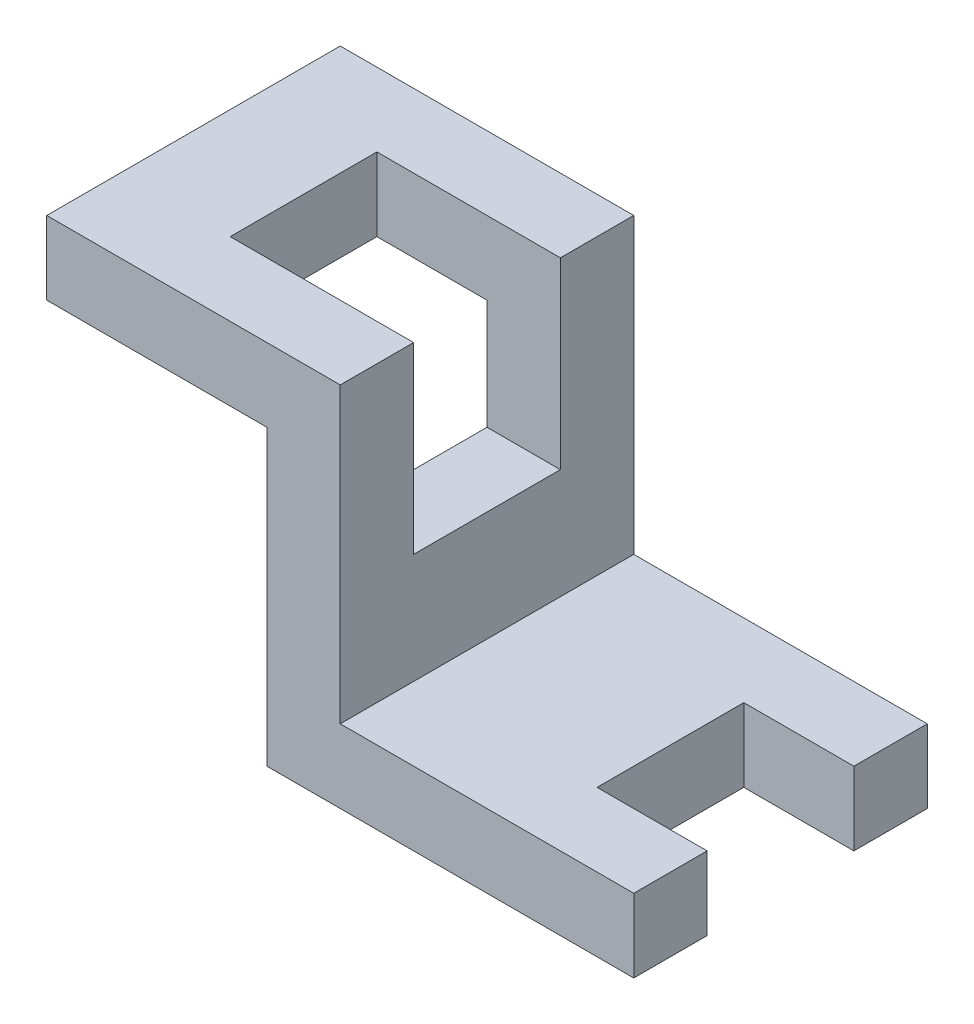
ISO-10303-21;
HEADER;
FILE_DESCRIPTION(('STEP AP214'),'2;1');
FILE_NAME('part.step','',(''),(''),'','','');
FILE_SCHEMA(('AUTOMOTIVE_DESIGN { 1 0 10303 214 1 1 1 1 }'));
ENDSEC;
DATA;
#1=APPLICATION_CONTEXT('core data for automotive mechanical design processes');
#2=APPLICATION_PROTOCOL_DEFINITION('international standard','automotive_design',2000,#1);
#3=PRODUCT_CONTEXT('',#1,'mechanical');
#4=PRODUCT('Part','Part','',(#3));
#5=PRODUCT_RELATED_PRODUCT_CATEGORY('part','',(#4));
#6=PRODUCT_DEFINITION_FORMATION('','',#4);
#7=PRODUCT_DEFINITION_CONTEXT('part definition',#1,'design');
#8=PRODUCT_DEFINITION('design','',#6,#7);
#9=PRODUCT_DEFINITION_SHAPE('','',#8);
#10=(LENGTH_UNIT() NAMED_UNIT(*) SI_UNIT(.MILLI.,.METRE.));
#11=(NAMED_UNIT(*) PLANE_ANGLE_UNIT() SI_UNIT($,.RADIAN.));
#12=(NAMED_UNIT(*) SI_UNIT($,.STERADIAN.) SOLID_ANGLE_UNIT());
#13=UNCERTAINTY_MEASURE_WITH_UNIT(LENGTH_MEASURE(1.E-05),#10,'distance_accuracy_value','');
#14=(GEOMETRIC_REPRESENTATION_CONTEXT(3) GLOBAL_UNCERTAINTY_ASSIGNED_CONTEXT((#13)) GLOBAL_UNIT_ASSIGNED_CONTEXT((#10,
#11,#12)) REPRESENTATION_CONTEXT('',''));
#15=CARTESIAN_POINT('',(0.,0.,0.));
#16=DIRECTION('',(0.,0.,1.));
#17=DIRECTION('',(1.,0.,0.));
#18=AXIS2_PLACEMENT_3D('',#15,#16,#17);
#19=CARTESIAN_POINT('',(80.,-50.,40.));
#20=DIRECTION('',(-1.,0.,0.));
#21=DIRECTION('',(0.,0.,1.));
#22=AXIS2_PLACEMENT_3D('',#19,#20,#21);
#23=PLANE('',#22);
#24=DIRECTION('',(0.,-1.,0.));
#25=VECTOR('',#24,1.);
#26=CARTESIAN_POINT('',(80.,-40.,30.));
#27=LINE('',#26,#25);
#28=CARTESIAN_POINT('',(80.,-40.,30.));
#29=VERTEX_POINT('',#28);
#30=CARTESIAN_POINT('',(80.,-50.,30.));
#31=VERTEX_POINT('',#30);
#32=EDGE_CURVE('E174',#29,#31,#27,.T.);
#33=ORIENTED_EDGE('',*,*,#32,.F.);
#34=DIRECTION('',(0.,0.,-1.));
#35=VECTOR('',#34,1.);
#36=CARTESIAN_POINT('',(80.,-40.,40.));
#37=LINE('',#36,#35);
#38=CARTESIAN_POINT('',(80.,-40.,40.));
#39=VERTEX_POINT('',#38);
#40=EDGE_CURVE('E170',#39,#29,#37,.T.);
#41=ORIENTED_EDGE('',*,*,#40,.F.);
#42=DIRECTION('',(0.,1.,0.));
#43=VECTOR('',#42,1.);
#44=CARTESIAN_POINT('',(80.,-50.,40.));
#45=LINE('',#44,#43);
#46=CARTESIAN_POINT('',(80.,-50.,40.));
#47=VERTEX_POINT('',#46);
#48=EDGE_CURVE('E266',#47,#39,#45,.T.);
#49=ORIENTED_EDGE('',*,*,#48,.F.);
#50=DIRECTION('',(0.,0.,-1.));
#51=VECTOR('',#50,1.);
#52=CARTESIAN_POINT('',(80.,-50.,40.));
#53=LINE('',#52,#51);
#54=EDGE_CURVE('E315',#47,#31,#53,.T.);
#55=ORIENTED_EDGE('',*,*,#54,.T.);
#56=EDGE_LOOP('',(#33,#41,#49,#55));
#57=FACE_BOUND('',#56,.T.);
#58=ADVANCED_FACE('F39',(#57),#23,.F.);
#59=CARTESIAN_POINT('',(30.,-50.,40.));
#60=DIRECTION('',(0.,1.,0.));
#61=DIRECTION('',(0.,0.,1.));
#62=AXIS2_PLACEMENT_3D('',#59,#60,#61);
#63=PLANE('',#62);
#64=DIRECTION('',(1.,0.,0.));
#65=VECTOR('',#64,1.);
#66=CARTESIAN_POINT('',(30.,-50.,10.));
#67=LINE('',#66,#65);
#68=CARTESIAN_POINT('',(65.,-50.,10.));
#69=VERTEX_POINT('',#68);
#70=CARTESIAN_POINT('',(80.,-50.,10.));
#71=VERTEX_POINT('',#70);
#72=EDGE_CURVE('E11',#69,#71,#67,.T.);
#73=ORIENTED_EDGE('',*,*,#72,.F.);
#74=DIRECTION('',(0.,0.,-1.));
#75=VECTOR('',#74,1.);
#76=CARTESIAN_POINT('',(65.,-50.,40.));
#77=LINE('',#76,#75);
#78=CARTESIAN_POINT('',(65.,-50.,30.));
#79=VERTEX_POINT('',#78);
#80=EDGE_CURVE('E57',#79,#69,#77,.T.);
#81=ORIENTED_EDGE('',*,*,#80,.F.);
#82=DIRECTION('',(-1.,0.,0.));
#83=VECTOR('',#82,1.);
#84=CARTESIAN_POINT('',(30.,-50.,30.));
#85=LINE('',#84,#83);
#86=EDGE_CURVE('E48',#31,#79,#85,.T.);
#87=ORIENTED_EDGE('',*,*,#86,.F.);
#88=ORIENTED_EDGE('',*,*,#54,.F.);
#89=DIRECTION('',(1.,0.,0.));
#90=VECTOR('',#89,1.);
#91=CARTESIAN_POINT('',(30.,-50.,40.));
#92=LINE('',#91,#90);
#93=CARTESIAN_POINT('',(30.,-50.,40.));
#94=VERTEX_POINT('',#93);
#95=EDGE_CURVE('E263',#94,#47,#92,.T.);
#96=ORIENTED_EDGE('',*,*,#95,.F.);
#97=DIRECTION('',(0.,0.,-1.));
#98=VECTOR('',#97,1.);
#99=CARTESIAN_POINT('',(30.,-50.,40.));
#100=LINE('',#99,#98);
#101=CARTESIAN_POINT('',(30.,-50.,0.));
#102=VERTEX_POINT('',#101);
#103=EDGE_CURVE('E319',#94,#102,#100,.T.);
#104=ORIENTED_EDGE('',*,*,#103,.T.);
#105=DIRECTION('',(1.,0.,0.));
#106=VECTOR('',#105,1.);
#107=CARTESIAN_POINT('',(30.,-50.,0.));
#108=LINE('',#107,#106);
#109=CARTESIAN_POINT('',(80.,-50.,0.));
#110=VERTEX_POINT('',#109);
#111=EDGE_CURVE('E289',#102,#110,#108,.T.);
#112=ORIENTED_EDGE('',*,*,#111,.T.);
#113=EDGE_CURVE('E314',#71,#110,#53,.T.);
#114=ORIENTED_EDGE('',*,*,#113,.F.);
#115=EDGE_LOOP('',(#73,#81,#87,#88,#96,#104,#112,#114));
#116=FACE_BOUND('',#115,.T.);
#117=ADVANCED_FACE('F379',(#116),#63,.F.);
#118=CARTESIAN_POINT('',(80.,-40.,40.));
#119=DIRECTION('',(0.,-1.,0.));
#120=DIRECTION('',(1.,0.,0.));
#121=AXIS2_PLACEMENT_3D('',#118,#119,#120);
#122=PLANE('',#121);
#123=DIRECTION('',(-1.,0.,0.));
#124=VECTOR('',#123,1.);
#125=CARTESIAN_POINT('',(80.,-40.,10.));
#126=LINE('',#125,#124);
#127=CARTESIAN_POINT('',(80.,-40.,10.));
#128=VERTEX_POINT('',#127);
#129=CARTESIAN_POINT('',(65.,-40.,10.));
#130=VERTEX_POINT('',#129);
#131=EDGE_CURVE('E191',#128,#130,#126,.T.);
#132=ORIENTED_EDGE('',*,*,#131,.F.);
#133=CARTESIAN_POINT('',(80.,-40.,0.));
#134=VERTEX_POINT('',#133);
#135=EDGE_CURVE('E311',#128,#134,#37,.T.);
#136=ORIENTED_EDGE('',*,*,#135,.T.);
#137=DIRECTION('',(-1.,0.,0.));
#138=VECTOR('',#137,1.);
#139=CARTESIAN_POINT('',(80.,-40.,0.));
#140=LINE('',#139,#138);
#141=CARTESIAN_POINT('',(40.,-40.,0.));
#142=VERTEX_POINT('',#141);
#143=EDGE_CURVE('E297',#134,#142,#140,.T.);
#144=ORIENTED_EDGE('',*,*,#143,.T.);
#145=DIRECTION('',(0.,0.,-1.));
#146=VECTOR('',#145,1.);
#147=CARTESIAN_POINT('',(40.,-40.,40.));
#148=LINE('',#147,#146);
#149=CARTESIAN_POINT('',(40.,-40.,40.));
#150=VERTEX_POINT('',#149);
#151=EDGE_CURVE('E307',#150,#142,#148,.T.);
#152=ORIENTED_EDGE('',*,*,#151,.F.);
#153=DIRECTION('',(-1.,0.,0.));
#154=VECTOR('',#153,1.);
#155=CARTESIAN_POINT('',(80.,-40.,40.));
#156=LINE('',#155,#154);
#157=EDGE_CURVE('E269',#39,#150,#156,.T.);
#158=ORIENTED_EDGE('',*,*,#157,.F.);
#159=ORIENTED_EDGE('',*,*,#40,.T.);
#160=DIRECTION('',(1.,0.,0.));
#161=VECTOR('',#160,1.);
#162=CARTESIAN_POINT('',(65.,-40.,30.));
#163=LINE('',#162,#161);
#164=CARTESIAN_POINT('',(65.,-40.,30.));
#165=VERTEX_POINT('',#164);
#166=EDGE_CURVE('E162',#165,#29,#163,.T.);
#167=ORIENTED_EDGE('',*,*,#166,.F.);
#168=DIRECTION('',(0.,0.,1.));
#169=VECTOR('',#168,1.);
#170=CARTESIAN_POINT('',(65.,-40.,10.));
#171=LINE('',#170,#169);
#172=EDGE_CURVE('E166',#130,#165,#171,.T.);
#173=ORIENTED_EDGE('',*,*,#172,.F.);
#174=EDGE_LOOP('',(#132,#136,#144,#152,#158,#159,#167,#173));
#175=FACE_BOUND('',#174,.T.);
#176=ADVANCED_FACE('F164',(#175),#122,.F.);
#177=CARTESIAN_POINT('',(0.,-10.,40.));
#178=DIRECTION('',(0.,1.,0.));
#179=DIRECTION('',(-1.,0.,0.));
#180=AXIS2_PLACEMENT_3D('',#177,#178,#179);
#181=PLANE('',#180);
#182=DIRECTION('',(-1.,0.,0.));
#183=VECTOR('',#182,1.);
#184=CARTESIAN_POINT('',(0.,-10.,30.));
#185=LINE('',#184,#183);
#186=CARTESIAN_POINT('',(30.,-10.,30.));
#187=VERTEX_POINT('',#186);
#188=CARTESIAN_POINT('',(15.,-10.,30.));
#189=VERTEX_POINT('',#188);
#190=EDGE_CURVE('E245',#187,#189,#185,.T.);
#191=ORIENTED_EDGE('',*,*,#190,.F.);
#192=DIRECTION('',(0.,0.,-1.));
#193=VECTOR('',#192,1.);
#194=CARTESIAN_POINT('',(30.,-10.,40.));
#195=LINE('',#194,#193);
#196=CARTESIAN_POINT('',(30.,-10.,40.));
#197=VERTEX_POINT('',#196);
#198=EDGE_CURVE('E324',#197,#187,#195,.T.);
#199=ORIENTED_EDGE('',*,*,#198,.F.);
#200=DIRECTION('',(1.,0.,0.));
#201=VECTOR('',#200,1.);
#202=CARTESIAN_POINT('',(0.,-10.,40.));
#203=LINE('',#202,#201);
#204=CARTESIAN_POINT('',(0.,-10.,40.));
#205=VERTEX_POINT('',#204);
#206=EDGE_CURVE('E257',#205,#197,#203,.T.);
#207=ORIENTED_EDGE('',*,*,#206,.F.);
#208=DIRECTION('',(0.,0.,-1.));
#209=VECTOR('',#208,1.);
#210=CARTESIAN_POINT('',(0.,-10.,40.));
#211=LINE('',#210,#209);
#212=CARTESIAN_POINT('',(0.,-10.,0.));
#213=VERTEX_POINT('',#212);
#214=EDGE_CURVE('E328',#205,#213,#211,.T.);
#215=ORIENTED_EDGE('',*,*,#214,.T.);
#216=DIRECTION('',(1.,0.,0.));
#217=VECTOR('',#216,1.);
#218=CARTESIAN_POINT('',(0.,-10.,0.));
#219=LINE('',#218,#217);
#220=CARTESIAN_POINT('',(30.,-10.,0.));
#221=VERTEX_POINT('',#220);
#222=EDGE_CURVE('E282',#213,#221,#219,.T.);
#223=ORIENTED_EDGE('',*,*,#222,.T.);
#224=CARTESIAN_POINT('',(30.,-10.,10.));
#225=VERTEX_POINT('',#224);
#226=EDGE_CURVE('E323',#225,#221,#195,.T.);
#227=ORIENTED_EDGE('',*,*,#226,.F.);
#228=DIRECTION('',(1.,0.,0.));
#229=VECTOR('',#228,1.);
#230=CARTESIAN_POINT('',(0.,-10.,10.));
#231=LINE('',#230,#229);
#232=CARTESIAN_POINT('',(15.,-10.,10.));
#233=VERTEX_POINT('',#232);
#234=EDGE_CURVE('E242',#233,#225,#231,.T.);
#235=ORIENTED_EDGE('',*,*,#234,.F.);
#236=DIRECTION('',(0.,0.,-1.));
#237=VECTOR('',#236,1.);
#238=CARTESIAN_POINT('',(15.,-10.,40.));
#239=LINE('',#238,#237);
#240=EDGE_CURVE('E343',#189,#233,#239,.T.);
#241=ORIENTED_EDGE('',*,*,#240,.F.);
#242=EDGE_LOOP('',(#191,#199,#207,#215,#223,#227,#235,#241));
#243=FACE_BOUND('',#242,.T.);
#244=ADVANCED_FACE('F392',(#243),#181,.F.);
#245=CARTESIAN_POINT('',(30.,-10.,40.));
#246=DIRECTION('',(1.,0.,0.));
#247=DIRECTION('',(0.,1.,0.));
#248=AXIS2_PLACEMENT_3D('',#245,#246,#247);
#249=PLANE('',#248);
#250=DIRECTION('',(0.,1.,0.));
#251=VECTOR('',#250,1.);
#252=CARTESIAN_POINT('',(30.,-10.,30.));
#253=LINE('',#252,#251);
#254=CARTESIAN_POINT('',(30.,-25.,30.));
#255=VERTEX_POINT('',#254);
#256=EDGE_CURVE('E340',#255,#187,#253,.T.);
#257=ORIENTED_EDGE('',*,*,#256,.F.);
#258=DIRECTION('',(0.,0.,-1.));
#259=VECTOR('',#258,1.);
#260=CARTESIAN_POINT('',(30.,-25.,40.));
#261=LINE('',#260,#259);
#262=CARTESIAN_POINT('',(30.,-25.,10.));
#263=VERTEX_POINT('',#262);
#264=EDGE_CURVE('E235',#255,#263,#261,.T.);
#265=ORIENTED_EDGE('',*,*,#264,.T.);
#266=DIRECTION('',(0.,-1.,0.));
#267=VECTOR('',#266,1.);
#268=CARTESIAN_POINT('',(30.,-10.,10.));
#269=LINE('',#268,#267);
#270=EDGE_CURVE('E336',#225,#263,#269,.T.);
#271=ORIENTED_EDGE('',*,*,#270,.F.);
#272=ORIENTED_EDGE('',*,*,#226,.T.);
#273=DIRECTION('',(0.,-1.,0.));
#274=VECTOR('',#273,1.);
#275=CARTESIAN_POINT('',(30.,-10.,0.));
#276=LINE('',#275,#274);
#277=EDGE_CURVE('E286',#221,#102,#276,.T.);
#278=ORIENTED_EDGE('',*,*,#277,.T.);
#279=ORIENTED_EDGE('',*,*,#103,.F.);
#280=DIRECTION('',(0.,-1.,0.));
#281=VECTOR('',#280,1.);
#282=CARTESIAN_POINT('',(30.,-10.,40.));
#283=LINE('',#282,#281);
#284=EDGE_CURVE('E260',#197,#94,#283,.T.);
#285=ORIENTED_EDGE('',*,*,#284,.F.);
#286=ORIENTED_EDGE('',*,*,#198,.T.);
#287=EDGE_LOOP('',(#257,#265,#271,#272,#278,#279,#285,#286));
#288=FACE_BOUND('',#287,.T.);
#289=ADVANCED_FACE('F386',(#288),#249,.F.);
#290=CARTESIAN_POINT('',(40.,0.,40.));
#291=DIRECTION('',(-1.,0.,0.));
#292=DIRECTION('',(0.,-1.,0.));
#293=AXIS2_PLACEMENT_3D('',#290,#291,#292);
#294=PLANE('',#293);
#295=DIRECTION('',(0.,-1.,0.));
#296=VECTOR('',#295,1.);
#297=CARTESIAN_POINT('',(40.,128.086884574495,30.));
#298=LINE('',#297,#296);
#299=CARTESIAN_POINT('',(40.,0.,30.));
#300=VERTEX_POINT('',#299);
#301=CARTESIAN_POINT('',(40.,-25.,30.));
#302=VERTEX_POINT('',#301);
#303=EDGE_CURVE('E228',#300,#302,#298,.T.);
#304=ORIENTED_EDGE('',*,*,#303,.F.);
#305=DIRECTION('',(0.,0.,-1.));
#306=VECTOR('',#305,1.);
#307=CARTESIAN_POINT('',(40.,0.,40.));
#308=LINE('',#307,#306);
#309=CARTESIAN_POINT('',(40.,0.,40.));
#310=VERTEX_POINT('',#309);
#311=EDGE_CURVE('E303',#310,#300,#308,.T.);
#312=ORIENTED_EDGE('',*,*,#311,.F.);
#313=DIRECTION('',(0.,1.,0.));
#314=VECTOR('',#313,1.);
#315=CARTESIAN_POINT('',(40.,0.,40.));
#316=LINE('',#315,#314);
#317=EDGE_CURVE('E272',#150,#310,#316,.T.);
#318=ORIENTED_EDGE('',*,*,#317,.F.);
#319=ORIENTED_EDGE('',*,*,#151,.T.);
#320=DIRECTION('',(0.,1.,0.));
#321=VECTOR('',#320,1.);
#322=CARTESIAN_POINT('',(40.,0.,0.));
#323=LINE('',#322,#321);
#324=CARTESIAN_POINT('',(40.,0.,0.));
#325=VERTEX_POINT('',#324);
#326=EDGE_CURVE('E254',#142,#325,#323,.T.);
#327=ORIENTED_EDGE('',*,*,#326,.T.);
#328=CARTESIAN_POINT('',(40.,0.,10.));
#329=VERTEX_POINT('',#328);
#330=EDGE_CURVE('E275',#329,#325,#308,.T.);
#331=ORIENTED_EDGE('',*,*,#330,.F.);
#332=DIRECTION('',(0.,-1.,0.));
#333=VECTOR('',#332,1.);
#334=CARTESIAN_POINT('',(40.,128.086884574495,10.));
#335=LINE('',#334,#333);
#336=CARTESIAN_POINT('',(40.,-25.,10.));
#337=VERTEX_POINT('',#336);
#338=EDGE_CURVE('E205',#329,#337,#335,.T.);
#339=ORIENTED_EDGE('',*,*,#338,.T.);
#340=DIRECTION('',(0.,0.,-1.));
#341=VECTOR('',#340,1.);
#342=CARTESIAN_POINT('',(40.,-25.,40.));
#343=LINE('',#342,#341);
#344=EDGE_CURVE('E200',#302,#337,#343,.T.);
#345=ORIENTED_EDGE('',*,*,#344,.F.);
#346=EDGE_LOOP('',(#304,#312,#318,#319,#327,#331,#339,#345));
#347=FACE_BOUND('',#346,.T.);
#348=ADVANCED_FACE('F368',(#347),#294,.F.);
#349=CARTESIAN_POINT('',(0.,0.,40.));
#350=DIRECTION('',(0.,-1.,0.));
#351=DIRECTION('',(0.,0.,-1.));
#352=AXIS2_PLACEMENT_3D('',#349,#350,#351);
#353=PLANE('',#352);
#354=ORIENTED_EDGE('',*,*,#311,.T.);
#355=DIRECTION('',(-1.,0.,0.));
#356=VECTOR('',#355,1.);
#357=CARTESIAN_POINT('',(15.,0.,30.));
#358=LINE('',#357,#356);
#359=CARTESIAN_POINT('',(15.,0.,30.));
#360=VERTEX_POINT('',#359);
#361=EDGE_CURVE('E210',#300,#360,#358,.T.);
#362=ORIENTED_EDGE('',*,*,#361,.T.);
#363=DIRECTION('',(0.,0.,-1.));
#364=VECTOR('',#363,1.);
#365=CARTESIAN_POINT('',(15.,0.,10.));
#366=LINE('',#365,#364);
#367=CARTESIAN_POINT('',(15.,0.,10.));
#368=VERTEX_POINT('',#367);
#369=EDGE_CURVE('E214',#360,#368,#366,.T.);
#370=ORIENTED_EDGE('',*,*,#369,.T.);
#371=DIRECTION('',(1.,0.,0.));
#372=VECTOR('',#371,1.);
#373=CARTESIAN_POINT('',(40.,0.,10.));
#374=LINE('',#373,#372);
#375=EDGE_CURVE('E209',#368,#329,#374,.T.);
#376=ORIENTED_EDGE('',*,*,#375,.T.);
#377=ORIENTED_EDGE('',*,*,#330,.T.);
#378=DIRECTION('',(-1.,0.,0.));
#379=VECTOR('',#378,1.);
#380=CARTESIAN_POINT('',(0.,0.,0.));
#381=LINE('',#380,#379);
#382=CARTESIAN_POINT('',(0.,0.,0.));
#383=VERTEX_POINT('',#382);
#384=EDGE_CURVE('E248',#325,#383,#381,.T.);
#385=ORIENTED_EDGE('',*,*,#384,.T.);
#386=DIRECTION('',(0.,0.,-1.));
#387=VECTOR('',#386,1.);
#388=CARTESIAN_POINT('',(0.,0.,40.));
#389=LINE('',#388,#387);
#390=CARTESIAN_POINT('',(0.,0.,40.));
#391=VERTEX_POINT('',#390);
#392=EDGE_CURVE('E332',#391,#383,#389,.T.);
#393=ORIENTED_EDGE('',*,*,#392,.F.);
#394=DIRECTION('',(-1.,0.,0.));
#395=VECTOR('',#394,1.);
#396=CARTESIAN_POINT('',(0.,0.,40.));
#397=LINE('',#396,#395);
#398=EDGE_CURVE('E249',#310,#391,#397,.T.);
#399=ORIENTED_EDGE('',*,*,#398,.F.);
#400=EDGE_LOOP('',(#354,#362,#370,#376,#377,#385,#393,#399));
#401=FACE_BOUND('',#400,.T.);
#402=ADVANCED_FACE('F41',(#401),#353,.F.);
#403=CARTESIAN_POINT('',(0.,0.,40.));
#404=DIRECTION('',(1.,0.,0.));
#405=DIRECTION('',(0.,0.,-1.));
#406=AXIS2_PLACEMENT_3D('',#403,#404,#405);
#407=PLANE('',#406);
#408=DIRECTION('',(0.,-1.,0.));
#409=VECTOR('',#408,1.);
#410=CARTESIAN_POINT('',(0.,0.,0.));
#411=LINE('',#410,#409);
#412=EDGE_CURVE('E279',#383,#213,#411,.T.);
#413=ORIENTED_EDGE('',*,*,#412,.T.);
#414=ORIENTED_EDGE('',*,*,#214,.F.);
#415=DIRECTION('',(0.,-1.,0.));
#416=VECTOR('',#415,1.);
#417=CARTESIAN_POINT('',(0.,0.,40.));
#418=LINE('',#417,#416);
#419=EDGE_CURVE('E253',#391,#205,#418,.T.);
#420=ORIENTED_EDGE('',*,*,#419,.F.);
#421=ORIENTED_EDGE('',*,*,#392,.T.);
#422=EDGE_LOOP('',(#413,#414,#420,#421));
#423=FACE_BOUND('',#422,.T.);
#424=ADVANCED_FACE('F397',(#423),#407,.F.);
#425=ORIENTED_EDGE('',*,*,#135,.F.);
#426=DIRECTION('',(0.,-1.,0.));
#427=VECTOR('',#426,1.);
#428=CARTESIAN_POINT('',(80.,-40.,10.));
#429=LINE('',#428,#427);
#430=EDGE_CURVE('E187',#128,#71,#429,.T.);
#431=ORIENTED_EDGE('',*,*,#430,.T.);
#432=ORIENTED_EDGE('',*,*,#113,.T.);
#433=DIRECTION('',(0.,1.,0.));
#434=VECTOR('',#433,1.);
#435=CARTESIAN_POINT('',(80.,-50.,0.));
#436=LINE('',#435,#434);
#437=EDGE_CURVE('E293',#110,#134,#436,.T.);
#438=ORIENTED_EDGE('',*,*,#437,.T.);
#439=EDGE_LOOP('',(#425,#431,#432,#438));
#440=FACE_BOUND('',#439,.T.);
#441=ADVANCED_FACE('F356',(#440),#23,.F.);
#442=CARTESIAN_POINT('',(0.,0.,40.));
#443=DIRECTION('',(0.,0.,-1.));
#444=DIRECTION('',(-1.,0.,0.));
#445=AXIS2_PLACEMENT_3D('',#442,#443,#444);
#446=PLANE('',#445);
#447=ORIENTED_EDGE('',*,*,#398,.T.);
#448=ORIENTED_EDGE('',*,*,#419,.T.);
#449=ORIENTED_EDGE('',*,*,#206,.T.);
#450=ORIENTED_EDGE('',*,*,#284,.T.);
#451=ORIENTED_EDGE('',*,*,#95,.T.);
#452=ORIENTED_EDGE('',*,*,#48,.T.);
#453=ORIENTED_EDGE('',*,*,#157,.T.);
#454=ORIENTED_EDGE('',*,*,#317,.T.);
#455=EDGE_LOOP('',(#447,#448,#449,#450,#451,#452,#453,#454));
#456=FACE_BOUND('',#455,.T.);
#457=ADVANCED_FACE('F373',(#456),#446,.F.);
#458=CARTESIAN_POINT('',(0.,0.,0.));
#459=DIRECTION('',(0.,0.,-1.));
#460=DIRECTION('',(-1.,0.,0.));
#461=AXIS2_PLACEMENT_3D('',#458,#459,#460);
#462=PLANE('',#461);
#463=ORIENTED_EDGE('',*,*,#384,.F.);
#464=ORIENTED_EDGE('',*,*,#326,.F.);
#465=ORIENTED_EDGE('',*,*,#143,.F.);
#466=ORIENTED_EDGE('',*,*,#437,.F.);
#467=ORIENTED_EDGE('',*,*,#111,.F.);
#468=ORIENTED_EDGE('',*,*,#277,.F.);
#469=ORIENTED_EDGE('',*,*,#222,.F.);
#470=ORIENTED_EDGE('',*,*,#412,.F.);
#471=EDGE_LOOP('',(#463,#464,#465,#466,#467,#468,#469,#470));
#472=FACE_BOUND('',#471,.T.);
#473=ADVANCED_FACE('F363',(#472),#462,.T.);
#474=CARTESIAN_POINT('',(15.,128.086884574495,10.));
#475=DIRECTION('',(1.,0.,0.));
#476=DIRECTION('',(0.,0.,-1.));
#477=AXIS2_PLACEMENT_3D('',#474,#475,#476);
#478=PLANE('',#477);
#479=DIRECTION('',(0.,-1.,0.));
#480=VECTOR('',#479,1.);
#481=CARTESIAN_POINT('',(15.,128.086884574495,30.));
#482=LINE('',#481,#480);
#483=EDGE_CURVE('E231',#360,#189,#482,.T.);
#484=ORIENTED_EDGE('',*,*,#483,.T.);
#485=ORIENTED_EDGE('',*,*,#240,.T.);
#486=DIRECTION('',(0.,-1.,0.));
#487=VECTOR('',#486,1.);
#488=CARTESIAN_POINT('',(15.,128.086884574495,10.));
#489=LINE('',#488,#487);
#490=EDGE_CURVE('E224',#368,#233,#489,.T.);
#491=ORIENTED_EDGE('',*,*,#490,.F.);
#492=ORIENTED_EDGE('',*,*,#369,.F.);
#493=EDGE_LOOP('',(#484,#485,#491,#492));
#494=FACE_BOUND('',#493,.T.);
#495=ADVANCED_FACE('F411',(#494),#478,.T.);
#496=CARTESIAN_POINT('',(15.,128.086884574495,30.));
#497=DIRECTION('',(0.,0.,-1.));
#498=DIRECTION('',(-1.,0.,0.));
#499=AXIS2_PLACEMENT_3D('',#496,#497,#498);
#500=PLANE('',#499);
#501=ORIENTED_EDGE('',*,*,#256,.T.);
#502=ORIENTED_EDGE('',*,*,#190,.T.);
#503=ORIENTED_EDGE('',*,*,#483,.F.);
#504=ORIENTED_EDGE('',*,*,#361,.F.);
#505=ORIENTED_EDGE('',*,*,#303,.T.);
#506=DIRECTION('',(-1.,0.,0.));
#507=VECTOR('',#506,1.);
#508=CARTESIAN_POINT('',(15.,-25.,30.));
#509=LINE('',#508,#507);
#510=EDGE_CURVE('E201',#302,#255,#509,.T.);
#511=ORIENTED_EDGE('',*,*,#510,.T.);
#512=EDGE_LOOP('',(#501,#502,#503,#504,#505,#511));
#513=FACE_BOUND('',#512,.T.);
#514=ADVANCED_FACE('F407',(#513),#500,.T.);
#515=CARTESIAN_POINT('',(40.,128.086884574495,10.));
#516=DIRECTION('',(0.,0.,1.));
#517=DIRECTION('',(1.,0.,0.));
#518=AXIS2_PLACEMENT_3D('',#515,#516,#517);
#519=PLANE('',#518);
#520=ORIENTED_EDGE('',*,*,#490,.T.);
#521=ORIENTED_EDGE('',*,*,#234,.T.);
#522=ORIENTED_EDGE('',*,*,#270,.T.);
#523=DIRECTION('',(1.,0.,0.));
#524=VECTOR('',#523,1.);
#525=CARTESIAN_POINT('',(40.,-25.,10.));
#526=LINE('',#525,#524);
#527=EDGE_CURVE('E206',#263,#337,#526,.T.);
#528=ORIENTED_EDGE('',*,*,#527,.T.);
#529=ORIENTED_EDGE('',*,*,#338,.F.);
#530=ORIENTED_EDGE('',*,*,#375,.F.);
#531=EDGE_LOOP('',(#520,#521,#522,#528,#529,#530));
#532=FACE_BOUND('',#531,.T.);
#533=ADVANCED_FACE('F401',(#532),#519,.T.);
#534=CARTESIAN_POINT('',(0.,-25.,40.));
#535=DIRECTION('',(0.,-1.,0.));
#536=DIRECTION('',(0.,0.,-1.));
#537=AXIS2_PLACEMENT_3D('',#534,#535,#536);
#538=PLANE('',#537);
#539=ORIENTED_EDGE('',*,*,#264,.F.);
#540=ORIENTED_EDGE('',*,*,#510,.F.);
#541=ORIENTED_EDGE('',*,*,#344,.T.);
#542=ORIENTED_EDGE('',*,*,#527,.F.);
#543=EDGE_LOOP('',(#539,#540,#541,#542));
#544=FACE_BOUND('',#543,.T.);
#545=ADVANCED_FACE('F405',(#544),#538,.F.);
#546=CARTESIAN_POINT('',(80.,-40.,10.));
#547=DIRECTION('',(0.,0.,1.));
#548=DIRECTION('',(1.,0.,0.));
#549=AXIS2_PLACEMENT_3D('',#546,#547,#548);
#550=PLANE('',#549);
#551=DIRECTION('',(0.,-1.,0.));
#552=VECTOR('',#551,1.);
#553=CARTESIAN_POINT('',(65.,-40.,10.));
#554=LINE('',#553,#552);
#555=EDGE_CURVE('E184',#130,#69,#554,.T.);
#556=ORIENTED_EDGE('',*,*,#555,.T.);
#557=ORIENTED_EDGE('',*,*,#72,.T.);
#558=ORIENTED_EDGE('',*,*,#430,.F.);
#559=ORIENTED_EDGE('',*,*,#131,.T.);
#560=EDGE_LOOP('',(#556,#557,#558,#559));
#561=FACE_BOUND('',#560,.T.);
#562=ADVANCED_FACE('F353',(#561),#550,.T.);
#563=CARTESIAN_POINT('',(65.,-40.,30.));
#564=DIRECTION('',(0.,0.,-1.));
#565=DIRECTION('',(-1.,0.,0.));
#566=AXIS2_PLACEMENT_3D('',#563,#564,#565);
#567=PLANE('',#566);
#568=ORIENTED_EDGE('',*,*,#32,.T.);
#569=ORIENTED_EDGE('',*,*,#86,.T.);
#570=DIRECTION('',(0.,-1.,0.));
#571=VECTOR('',#570,1.);
#572=CARTESIAN_POINT('',(65.,-40.,30.));
#573=LINE('',#572,#571);
#574=EDGE_CURVE('E175',#165,#79,#573,.T.);
#575=ORIENTED_EDGE('',*,*,#574,.F.);
#576=ORIENTED_EDGE('',*,*,#166,.T.);
#577=EDGE_LOOP('',(#568,#569,#575,#576));
#578=FACE_BOUND('',#577,.T.);
#579=ADVANCED_FACE('F178',(#578),#567,.T.);
#580=CARTESIAN_POINT('',(65.,-40.,10.));
#581=DIRECTION('',(1.,0.,0.));
#582=DIRECTION('',(0.,1.,0.));
#583=AXIS2_PLACEMENT_3D('',#580,#581,#582);
#584=PLANE('',#583);
#585=ORIENTED_EDGE('',*,*,#574,.T.);
#586=ORIENTED_EDGE('',*,*,#80,.T.);
#587=ORIENTED_EDGE('',*,*,#555,.F.);
#588=ORIENTED_EDGE('',*,*,#172,.T.);
#589=EDGE_LOOP('',(#585,#586,#587,#588));
#590=FACE_BOUND('',#589,.T.);
#591=ADVANCED_FACE('F182',(#590),#584,.T.);
#592=CLOSED_SHELL('',(#58,#117,#176,#244,#289,#348,#402,#424,#441,#457,#473,#495,#514,#533,#545,
#562,#579,#591));
#593=MANIFOLD_SOLID_BREP('B2',#592);
#594=ADVANCED_BREP_SHAPE_REPRESENTATION('',(#18,#593),#14);
#595=SHAPE_DEFINITION_REPRESENTATION(#9,#594);
ENDSEC;
END-ISO-10303-21;
